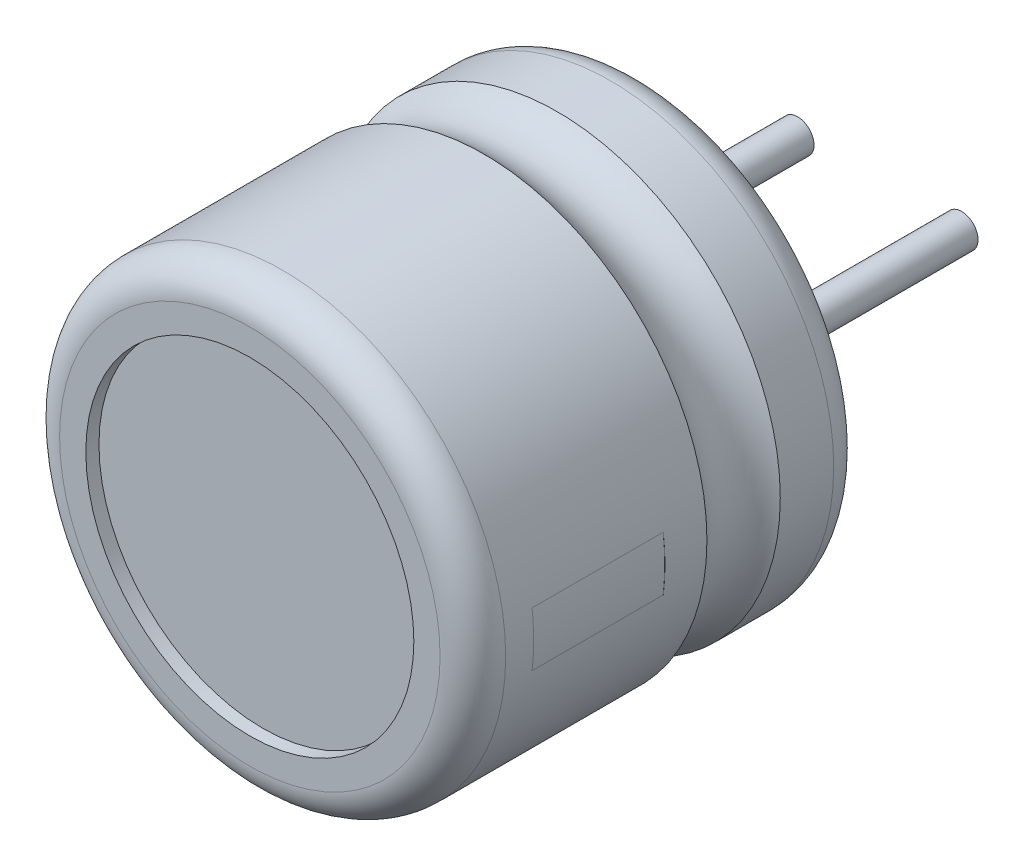
ISO-10303-21;
HEADER;
FILE_DESCRIPTION(('STEP AP214'),'2;1');
FILE_NAME('part.step','',(''),(''),'','','');
FILE_SCHEMA(('AUTOMOTIVE_DESIGN { 1 0 10303 214 1 1 1 1 }'));
ENDSEC;
DATA;
#1=APPLICATION_CONTEXT('core data for automotive mechanical design processes');
#2=APPLICATION_PROTOCOL_DEFINITION('international standard','automotive_design',2000,#1);
#3=PRODUCT_CONTEXT('',#1,'mechanical');
#4=PRODUCT('Part','Part','',(#3));
#5=PRODUCT_RELATED_PRODUCT_CATEGORY('part','',(#4));
#6=PRODUCT_DEFINITION_FORMATION('','',#4);
#7=PRODUCT_DEFINITION_CONTEXT('part definition',#1,'design');
#8=PRODUCT_DEFINITION('design','',#6,#7);
#9=PRODUCT_DEFINITION_SHAPE('','',#8);
#10=(LENGTH_UNIT() NAMED_UNIT(*) SI_UNIT(.MILLI.,.METRE.));
#11=(NAMED_UNIT(*) PLANE_ANGLE_UNIT() SI_UNIT($,.RADIAN.));
#12=(NAMED_UNIT(*) SI_UNIT($,.STERADIAN.) SOLID_ANGLE_UNIT());
#13=UNCERTAINTY_MEASURE_WITH_UNIT(LENGTH_MEASURE(1.E-05),#10,'distance_accuracy_value','');
#14=(GEOMETRIC_REPRESENTATION_CONTEXT(3) GLOBAL_UNCERTAINTY_ASSIGNED_CONTEXT((#13)) GLOBAL_UNIT_ASSIGNED_CONTEXT((#10,
#11,#12)) REPRESENTATION_CONTEXT('',''));
#15=CARTESIAN_POINT('',(0.,0.,0.));
#16=DIRECTION('',(0.,0.,1.));
#17=DIRECTION('',(1.,0.,0.));
#18=AXIS2_PLACEMENT_3D('',#15,#16,#17);
#19=CARTESIAN_POINT('',(0.,0.,5.8));
#20=DIRECTION('',(0.,0.,1.));
#21=DIRECTION('',(1.,0.,0.));
#22=AXIS2_PLACEMENT_3D('',#19,#20,#21);
#23=PLANE('',#22);
#24=CARTESIAN_POINT('',(0.,0.,5.8));
#25=DIRECTION('',(0.,0.,-1.));
#26=DIRECTION('',(-1.,0.,0.));
#27=AXIS2_PLACEMENT_3D('',#24,#25,#26);
#28=CIRCLE('',#27,2.5);
#29=CARTESIAN_POINT('',(-2.5,0.,5.8));
#30=VERTEX_POINT('',#29);
#31=EDGE_CURVE('P0_E26',#30,#30,#28,.T.);
#32=ORIENTED_EDGE('',*,*,#31,.F.);
#33=EDGE_LOOP('',(#32));
#34=FACE_BOUND('',#33,.T.);
#35=ADVANCED_FACE('P0_F23',(#34),#23,.T.);
#36=CARTESIAN_POINT('',(0.,0.,5.8));
#37=DIRECTION('',(0.,0.,-1.));
#38=DIRECTION('',(-1.,0.,0.));
#39=AXIS2_PLACEMENT_3D('',#36,#37,#38);
#40=CYLINDRICAL_SURFACE('',#39,2.5);
#41=CARTESIAN_POINT('',(0.,0.,5.7));
#42=DIRECTION('',(0.,0.,-1.));
#43=DIRECTION('',(-1.,0.,0.));
#44=AXIS2_PLACEMENT_3D('',#41,#42,#43);
#45=CIRCLE('',#44,2.5);
#46=CARTESIAN_POINT('',(-2.5,0.,5.7));
#47=VERTEX_POINT('',#46);
#48=EDGE_CURVE('P0_E12',#47,#47,#45,.F.);
#49=ORIENTED_EDGE('',*,*,#48,.T.);
#50=EDGE_LOOP('',(#49));
#51=FACE_BOUND('',#50,.T.);
#52=ORIENTED_EDGE('',*,*,#31,.T.);
#53=EDGE_LOOP('',(#52));
#54=FACE_BOUND('',#53,.T.);
#55=ADVANCED_FACE('P0_F35',(#51,#54),#40,.T.);
#56=CARTESIAN_POINT('',(0.,0.,5.7));
#57=DIRECTION('',(0.,0.,1.));
#58=DIRECTION('',(1.,0.,0.));
#59=AXIS2_PLACEMENT_3D('',#56,#57,#58);
#60=PLANE('',#59);
#61=ORIENTED_EDGE('',*,*,#48,.F.);
#62=EDGE_LOOP('',(#61));
#63=FACE_BOUND('',#62,.T.);
#64=ADVANCED_FACE('P0_F42',(#63),#60,.F.);
#65=CLOSED_SHELL('',(#35,#55,#64));
#66=MANIFOLD_SOLID_BREP('P0_B1',#65);
#67=CARTESIAN_POINT('',(1.25,0.,0.));
#68=DIRECTION('',(0.,0.,1.));
#69=DIRECTION('',(1.,0.,0.));
#70=AXIS2_PLACEMENT_3D('',#67,#68,#69);
#71=PLANE('',#70);
#72=CARTESIAN_POINT('',(1.25,0.,0.));
#73=DIRECTION('',(0.,0.,-1.));
#74=DIRECTION('',(-1.,0.,0.));
#75=AXIS2_PLACEMENT_3D('',#72,#73,#74);
#76=CIRCLE('',#75,0.25);
#77=CARTESIAN_POINT('',(1.,0.,0.));
#78=VERTEX_POINT('',#77);
#79=EDGE_CURVE('P1_E26',#78,#78,#76,.T.);
#80=ORIENTED_EDGE('',*,*,#79,.F.);
#81=EDGE_LOOP('',(#80));
#82=FACE_BOUND('',#81,.T.);
#83=ADVANCED_FACE('P1_F23',(#82),#71,.T.);
#84=CARTESIAN_POINT('',(1.25,0.,-3.6));
#85=DIRECTION('',(0.,0.,1.));
#86=DIRECTION('',(1.,0.,0.));
#87=AXIS2_PLACEMENT_3D('',#84,#85,#86);
#88=PLANE('',#87);
#89=CARTESIAN_POINT('',(1.25,0.,-3.6));
#90=DIRECTION('',(0.,0.,-1.));
#91=DIRECTION('',(-1.,0.,0.));
#92=AXIS2_PLACEMENT_3D('',#89,#90,#91);
#93=CIRCLE('',#92,0.25);
#94=CARTESIAN_POINT('',(1.,0.,-3.6));
#95=VERTEX_POINT('',#94);
#96=EDGE_CURVE('P1_E12',#95,#95,#93,.F.);
#97=ORIENTED_EDGE('',*,*,#96,.F.);
#98=EDGE_LOOP('',(#97));
#99=FACE_BOUND('',#98,.T.);
#100=ADVANCED_FACE('P1_F38',(#99),#88,.F.);
#101=CARTESIAN_POINT('',(1.25,0.,0.));
#102=DIRECTION('',(0.,0.,-1.));
#103=DIRECTION('',(-1.,0.,0.));
#104=AXIS2_PLACEMENT_3D('',#101,#102,#103);
#105=CYLINDRICAL_SURFACE('',#104,0.25);
#106=ORIENTED_EDGE('',*,*,#79,.T.);
#107=EDGE_LOOP('',(#106));
#108=FACE_BOUND('',#107,.T.);
#109=ORIENTED_EDGE('',*,*,#96,.T.);
#110=EDGE_LOOP('',(#109));
#111=FACE_BOUND('',#110,.T.);
#112=ADVANCED_FACE('P1_F35',(#108,#111),#105,.T.);
#113=CLOSED_SHELL('',(#83,#100,#112));
#114=MANIFOLD_SOLID_BREP('P1_B1',#113);
#115=CARTESIAN_POINT('',(3.275402300416,-0.402168833237,5.073205445782));
#116=DIRECTION('',(-0.121869343405041,-0.992546151641335,0.));
#117=DIRECTION('',(0.992546151641335,-0.121869343405041,0.));
#118=AXIS2_PLACEMENT_3D('',#115,#116,#117);
#119=PLANE('',#118);
#120=DIRECTION('',(0.992546151641335,-0.121869343405041,0.));
#121=VECTOR('',#120,1.);
#122=CARTESIAN_POINT('',(3.275402300416,-0.402168833237,5.073205445782));
#123=LINE('',#122,#121);
#124=CARTESIAN_POINT('',(3.37465691558045,-0.414355767577799,5.073205445782));
#125=VERTEX_POINT('',#124);
#126=CARTESIAN_POINT('',(3.27540230041618,-0.402168833237022,5.073205445782));
#127=VERTEX_POINT('',#126);
#128=EDGE_CURVE('P2_E62',#125,#127,#123,.F.);
#129=ORIENTED_EDGE('',*,*,#128,.T.);
#130=DIRECTION('',(0.,0.,1.));
#131=VECTOR('',#130,1.);
#132=CARTESIAN_POINT('',(3.275402300416,-0.402168833237,5.073205445782));
#133=LINE('',#132,#131);
#134=CARTESIAN_POINT('',(3.27540230041618,-0.402168833237022,3.073205445782));
#135=VERTEX_POINT('',#134);
#136=EDGE_CURVE('P2_E65',#127,#135,#133,.F.);
#137=ORIENTED_EDGE('',*,*,#136,.T.);
#138=DIRECTION('',(0.992546151641335,-0.121869343405041,0.));
#139=VECTOR('',#138,1.);
#140=CARTESIAN_POINT('',(3.275402300416,-0.402168833237,3.073205445782));
#141=LINE('',#140,#139);
#142=CARTESIAN_POINT('',(3.37465691558045,-0.414355767577799,3.073205445782));
#143=VERTEX_POINT('',#142);
#144=EDGE_CURVE('P2_E72',#135,#143,#141,.T.);
#145=ORIENTED_EDGE('',*,*,#144,.T.);
#146=DIRECTION('',(0.,0.,-1.));
#147=VECTOR('',#146,1.);
#148=CARTESIAN_POINT('',(3.37465691558042,-0.414355767578051,5.073205445782));
#149=LINE('',#148,#147);
#150=EDGE_CURVE('P2_E64',#125,#143,#149,.T.);
#151=ORIENTED_EDGE('',*,*,#150,.F.);
#152=EDGE_LOOP('',(#129,#137,#145,#151));
#153=FACE_BOUND('',#152,.T.);
#154=ADVANCED_FACE('P2_F17',(#153),#119,.T.);
#155=CARTESIAN_POINT('',(0.,0.,5.073205445782));
#156=DIRECTION('',(0.,0.,-1.));
#157=DIRECTION('',(-1.,0.,0.));
#158=AXIS2_PLACEMENT_3D('',#155,#156,#157);
#159=CYLINDRICAL_SURFACE('',#158,3.3);
#160=CARTESIAN_POINT('',(0.,0.,5.073205445782));
#161=DIRECTION('',(0.,0.,-1.));
#162=DIRECTION('',(-1.,0.,0.));
#163=AXIS2_PLACEMENT_3D('',#160,#161,#162);
#164=CIRCLE('',#163,3.3);
#165=CARTESIAN_POINT('',(3.27540230041615,0.402168833237274,5.073205445782));
#166=VERTEX_POINT('',#165);
#167=EDGE_CURVE('P2_E20',#166,#127,#164,.T.);
#168=ORIENTED_EDGE('',*,*,#167,.F.);
#169=DIRECTION('',(0.,0.,1.));
#170=VECTOR('',#169,1.);
#171=CARTESIAN_POINT('',(3.27540230041594,0.402168833237505,5.073205445782));
#172=LINE('',#171,#170);
#173=CARTESIAN_POINT('',(3.27540230041612,0.402168833237527,3.073205445782));
#174=VERTEX_POINT('',#173);
#175=EDGE_CURVE('P2_E82',#174,#166,#172,.T.);
#176=ORIENTED_EDGE('',*,*,#175,.F.);
#177=CARTESIAN_POINT('',(0.,0.,3.073205445782));
#178=DIRECTION('',(0.,0.,-1.));
#179=DIRECTION('',(-1.,0.,0.));
#180=AXIS2_PLACEMENT_3D('',#177,#178,#179);
#181=CIRCLE('',#180,3.3);
#182=EDGE_CURVE('P2_E55',#174,#135,#181,.T.);
#183=ORIENTED_EDGE('',*,*,#182,.T.);
#184=ORIENTED_EDGE('',*,*,#136,.F.);
#185=EDGE_LOOP('',(#168,#176,#183,#184));
#186=FACE_BOUND('',#185,.T.);
#187=ADVANCED_FACE('P2_F67',(#186),#159,.F.);
#188=CARTESIAN_POINT('',(3.339040636882,0.,3.073205445782));
#189=DIRECTION('',(0.,0.,1.));
#190=DIRECTION('',(1.,0.,0.));
#191=AXIS2_PLACEMENT_3D('',#188,#189,#190);
#192=PLANE('',#191);
#193=ORIENTED_EDGE('',*,*,#144,.F.);
#194=ORIENTED_EDGE('',*,*,#182,.F.);
#195=DIRECTION('',(-0.992546151641335,-0.121869343405041,0.));
#196=VECTOR('',#195,1.);
#197=CARTESIAN_POINT('',(3.37465691558,0.414355767578,3.073205445782));
#198=LINE('',#197,#196);
#199=CARTESIAN_POINT('',(3.37465691558042,0.414355767578051,3.073205445782));
#200=VERTEX_POINT('',#199);
#201=EDGE_CURVE('P2_E80',#200,#174,#198,.T.);
#202=ORIENTED_EDGE('',*,*,#201,.F.);
#203=CARTESIAN_POINT('',(0.,0.,3.073205445782));
#204=DIRECTION('',(0.,0.,-1.));
#205=DIRECTION('',(-1.,0.,0.));
#206=AXIS2_PLACEMENT_3D('',#203,#204,#205);
#207=CIRCLE('',#206,3.4);
#208=EDGE_CURVE('P2_E78',#143,#200,#207,.F.);
#209=ORIENTED_EDGE('',*,*,#208,.F.);
#210=EDGE_LOOP('',(#193,#194,#202,#209));
#211=FACE_BOUND('',#210,.T.);
#212=ADVANCED_FACE('P2_F91',(#211),#192,.F.);
#213=CARTESIAN_POINT('',(3.37465691558,0.414355767578,5.073205445782));
#214=DIRECTION('',(-0.121869343405041,0.992546151641335,0.));
#215=DIRECTION('',(-0.992546151641335,-0.121869343405041,0.));
#216=AXIS2_PLACEMENT_3D('',#213,#214,#215);
#217=PLANE('',#216);
#218=DIRECTION('',(-0.992546151640715,-0.121869343410088,0.));
#219=VECTOR('',#218,1.);
#220=CARTESIAN_POINT('',(3.37465691558,0.414355767578,5.073205445782));
#221=LINE('',#220,#219);
#222=CARTESIAN_POINT('',(3.37465691558042,0.414355767578051,5.073205445782));
#223=VERTEX_POINT('',#222);
#224=EDGE_CURVE('P2_E35',#223,#166,#221,.T.);
#225=ORIENTED_EDGE('',*,*,#224,.F.);
#226=DIRECTION('',(0.,0.,-1.));
#227=VECTOR('',#226,1.);
#228=CARTESIAN_POINT('',(3.37465691558042,0.414355767578051,5.073205445782));
#229=LINE('',#228,#227);
#230=EDGE_CURVE('P2_E26',#200,#223,#229,.F.);
#231=ORIENTED_EDGE('',*,*,#230,.F.);
#232=ORIENTED_EDGE('',*,*,#201,.T.);
#233=ORIENTED_EDGE('',*,*,#175,.T.);
#234=EDGE_LOOP('',(#225,#231,#232,#233));
#235=FACE_BOUND('',#234,.T.);
#236=ADVANCED_FACE('P2_F89',(#235),#217,.T.);
#237=CARTESIAN_POINT('',(3.339040636882,0.,5.073205445782));
#238=DIRECTION('',(0.,0.,1.));
#239=DIRECTION('',(1.,0.,0.));
#240=AXIS2_PLACEMENT_3D('',#237,#238,#239);
#241=PLANE('',#240);
#242=CARTESIAN_POINT('',(0.,0.,5.073205445782));
#243=DIRECTION('',(0.,0.,-1.));
#244=DIRECTION('',(-1.,0.,0.));
#245=AXIS2_PLACEMENT_3D('',#242,#243,#244);
#246=CIRCLE('',#245,3.4);
#247=EDGE_CURVE('P2_E11',#223,#125,#246,.T.);
#248=ORIENTED_EDGE('',*,*,#247,.F.);
#249=ORIENTED_EDGE('',*,*,#224,.T.);
#250=ORIENTED_EDGE('',*,*,#167,.T.);
#251=ORIENTED_EDGE('',*,*,#128,.F.);
#252=EDGE_LOOP('',(#248,#249,#250,#251));
#253=FACE_BOUND('',#252,.T.);
#254=ADVANCED_FACE('P2_F60',(#253),#241,.T.);
#255=CARTESIAN_POINT('',(0.,0.,5.073205445782));
#256=DIRECTION('',(0.,0.,-1.));
#257=DIRECTION('',(-1.,0.,0.));
#258=AXIS2_PLACEMENT_3D('',#255,#256,#257);
#259=CYLINDRICAL_SURFACE('',#258,3.4);
#260=ORIENTED_EDGE('',*,*,#230,.T.);
#261=ORIENTED_EDGE('',*,*,#247,.T.);
#262=ORIENTED_EDGE('',*,*,#150,.T.);
#263=ORIENTED_EDGE('',*,*,#208,.T.);
#264=EDGE_LOOP('',(#260,#261,#262,#263));
#265=FACE_BOUND('',#264,.T.);
#266=ADVANCED_FACE('P2_F86',(#265),#259,.T.);
#267=CLOSED_SHELL('',(#154,#187,#212,#236,#254,#266));
#268=MANIFOLD_SOLID_BREP('P2_B1',#267);
#269=CARTESIAN_POINT('',(0.,0.,0.2));
#270=DIRECTION('',(0.,0.,1.));
#271=DIRECTION('',(1.,0.,0.));
#272=AXIS2_PLACEMENT_3D('',#269,#270,#271);
#273=PLANE('',#272);
#274=CARTESIAN_POINT('',(0.,0.,0.2));
#275=DIRECTION('',(0.,0.,1.));
#276=DIRECTION('',(1.,0.,0.));
#277=AXIS2_PLACEMENT_3D('',#274,#275,#276);
#278=CIRCLE('',#277,2.5);
#279=CARTESIAN_POINT('',(2.5,0.,0.2));
#280=VERTEX_POINT('',#279);
#281=EDGE_CURVE('P3_E95',#280,#280,#278,.F.);
#282=ORIENTED_EDGE('',*,*,#281,.T.);
#283=EDGE_LOOP('',(#282));
#284=FACE_BOUND('',#283,.T.);
#285=ADVANCED_FACE('P3_F25',(#284),#273,.F.);
#286=CARTESIAN_POINT('',(0.,0.,0.));
#287=DIRECTION('',(0.,0.,1.));
#288=DIRECTION('',(1.,0.,0.));
#289=AXIS2_PLACEMENT_3D('',#286,#287,#288);
#290=CYLINDRICAL_SURFACE('',#289,2.5);
#291=ORIENTED_EDGE('',*,*,#281,.F.);
#292=EDGE_LOOP('',(#291));
#293=FACE_BOUND('',#292,.T.);
#294=CARTESIAN_POINT('',(0.,0.,0.));
#295=DIRECTION('',(0.,0.,1.));
#296=DIRECTION('',(1.,0.,0.));
#297=AXIS2_PLACEMENT_3D('',#294,#295,#296);
#298=CIRCLE('',#297,2.5);
#299=CARTESIAN_POINT('',(2.5,0.,0.));
#300=VERTEX_POINT('',#299);
#301=EDGE_CURVE('P3_E94',#300,#300,#298,.F.);
#302=ORIENTED_EDGE('',*,*,#301,.T.);
#303=EDGE_LOOP('',(#302));
#304=FACE_BOUND('',#303,.T.);
#305=ADVANCED_FACE('P3_F143',(#293,#304),#290,.F.);
#306=CARTESIAN_POINT('',(0.,0.,0.));
#307=DIRECTION('',(0.,0.,1.));
#308=DIRECTION('',(1.,0.,0.));
#309=AXIS2_PLACEMENT_3D('',#306,#307,#308);
#310=PLANE('',#309);
#311=ORIENTED_EDGE('',*,*,#301,.F.);
#312=EDGE_LOOP('',(#311));
#313=FACE_BOUND('',#312,.T.);
#314=CARTESIAN_POINT('',(0.,0.,0.));
#315=DIRECTION('',(0.,0.,1.));
#316=DIRECTION('',(-1.,0.,0.));
#317=AXIS2_PLACEMENT_3D('',#314,#315,#316);
#318=CIRCLE('',#317,2.9);
#319=CARTESIAN_POINT('',(-2.9,0.,0.));
#320=VERTEX_POINT('',#319);
#321=CARTESIAN_POINT('',(2.9,0.,0.));
#322=VERTEX_POINT('',#321);
#323=EDGE_CURVE('P3_E92',#320,#322,#318,.T.);
#324=ORIENTED_EDGE('',*,*,#323,.F.);
#325=CARTESIAN_POINT('',(0.,0.,0.));
#326=DIRECTION('',(0.,0.,1.));
#327=DIRECTION('',(1.,0.,0.));
#328=AXIS2_PLACEMENT_3D('',#325,#326,#327);
#329=CIRCLE('',#328,2.9);
#330=EDGE_CURVE('P3_E86',#322,#320,#329,.T.);
#331=ORIENTED_EDGE('',*,*,#330,.F.);
#332=EDGE_LOOP('',(#324,#331));
#333=FACE_BOUND('',#332,.T.);
#334=ADVANCED_FACE('P3_F91',(#313,#333),#310,.F.);
#335=CARTESIAN_POINT('',(0.,0.,5.7));
#336=DIRECTION('',(0.,0.,1.));
#337=DIRECTION('',(1.,0.,0.));
#338=AXIS2_PLACEMENT_3D('',#335,#336,#337);
#339=PLANE('',#338);
#340=CARTESIAN_POINT('',(0.,0.,5.7));
#341=DIRECTION('',(0.,0.,-1.));
#342=DIRECTION('',(-1.,0.,0.));
#343=AXIS2_PLACEMENT_3D('',#340,#341,#342);
#344=CIRCLE('',#343,2.5);
#345=CARTESIAN_POINT('',(-2.5,0.,5.7));
#346=VERTEX_POINT('',#345);
#347=EDGE_CURVE('P3_E101',#346,#346,#344,.F.);
#348=ORIENTED_EDGE('',*,*,#347,.T.);
#349=EDGE_LOOP('',(#348));
#350=FACE_BOUND('',#349,.T.);
#351=ADVANCED_FACE('P3_F122',(#350),#339,.T.);
#352=CARTESIAN_POINT('',(0.,0.,0.5));
#353=DIRECTION('',(0.,0.,1.));
#354=DIRECTION('',(1.,0.,0.));
#355=AXIS2_PLACEMENT_3D('',#352,#353,#354);
#356=TOROIDAL_SURFACE('',#355,2.9,0.5);
#357=ORIENTED_EDGE('',*,*,#323,.T.);
#358=ORIENTED_EDGE('',*,*,#330,.T.);
#359=EDGE_LOOP('',(#357,#358));
#360=FACE_BOUND('',#359,.T.);
#361=CARTESIAN_POINT('',(0.,0.,0.5));
#362=DIRECTION('',(0.,0.,1.));
#363=DIRECTION('',(1.,0.,0.));
#364=AXIS2_PLACEMENT_3D('',#361,#362,#363);
#365=CIRCLE('',#364,3.4);
#366=CARTESIAN_POINT('',(3.4,0.,0.5));
#367=VERTEX_POINT('',#366);
#368=EDGE_CURVE('P3_E109',#367,#367,#365,.T.);
#369=ORIENTED_EDGE('',*,*,#368,.F.);
#370=EDGE_LOOP('',(#369));
#371=FACE_BOUND('',#370,.T.);
#372=ADVANCED_FACE('P3_F99',(#360,#371),#356,.T.);
#373=CARTESIAN_POINT('',(0.,0.,6.));
#374=DIRECTION('',(0.,0.,-1.));
#375=DIRECTION('',(-1.,0.,0.));
#376=AXIS2_PLACEMENT_3D('',#373,#374,#375);
#377=CYLINDRICAL_SURFACE('',#376,2.5);
#378=CARTESIAN_POINT('',(0.,0.,6.));
#379=DIRECTION('',(0.,0.,-1.));
#380=DIRECTION('',(-1.,0.,0.));
#381=AXIS2_PLACEMENT_3D('',#378,#379,#380);
#382=CIRCLE('',#381,2.5);
#383=CARTESIAN_POINT('',(-2.5,0.,6.));
#384=VERTEX_POINT('',#383);
#385=EDGE_CURVE('P3_E234',#384,#384,#382,.T.);
#386=ORIENTED_EDGE('',*,*,#385,.F.);
#387=EDGE_LOOP('',(#386));
#388=FACE_BOUND('',#387,.T.);
#389=ORIENTED_EDGE('',*,*,#347,.F.);
#390=EDGE_LOOP('',(#389));
#391=FACE_BOUND('',#390,.T.);
#392=ADVANCED_FACE('P3_F121',(#388,#391),#377,.F.);
#393=CARTESIAN_POINT('',(0.,0.,0.));
#394=DIRECTION('',(0.,0.,1.));
#395=DIRECTION('',(1.,0.,0.));
#396=AXIS2_PLACEMENT_3D('',#393,#394,#395);
#397=CYLINDRICAL_SURFACE('',#396,3.4);
#398=ORIENTED_EDGE('',*,*,#368,.T.);
#399=EDGE_LOOP('',(#398));
#400=FACE_BOUND('',#399,.T.);
#401=CARTESIAN_POINT('',(0.,0.,1.31434670772803));
#402=DIRECTION('',(0.,0.,1.));
#403=DIRECTION('',(1.,0.,0.));
#404=AXIS2_PLACEMENT_3D('',#401,#402,#403);
#405=CIRCLE('',#404,3.40000000000003);
#406=CARTESIAN_POINT('',(3.40000000000003,0.,1.31434670772803));
#407=VERTEX_POINT('',#406);
#408=EDGE_CURVE('P3_E130',#407,#407,#405,.F.);
#409=ORIENTED_EDGE('',*,*,#408,.T.);
#410=EDGE_LOOP('',(#409));
#411=FACE_BOUND('',#410,.T.);
#412=ADVANCED_FACE('P3_F262',(#400,#411),#397,.T.);
#413=CARTESIAN_POINT('',(0.,0.,5.073205445782));
#414=DIRECTION('',(0.,0.,-1.));
#415=DIRECTION('',(-1.,0.,0.));
#416=AXIS2_PLACEMENT_3D('',#413,#414,#415);
#417=CYLINDRICAL_SURFACE('',#416,3.3);
#418=DIRECTION('',(0.,0.,1.));
#419=VECTOR('',#418,1.);
#420=CARTESIAN_POINT('',(3.275402300416,-0.402168833237,5.073205445782));
#421=LINE('',#420,#419);
#422=CARTESIAN_POINT('',(3.27540230041618,-0.402168833237022,5.073205445782));
#423=VERTEX_POINT('',#422);
#424=CARTESIAN_POINT('',(3.27540230041618,-0.402168833237022,3.073205445782));
#425=VERTEX_POINT('',#424);
#426=EDGE_CURVE('P3_E128',#423,#425,#421,.F.);
#427=ORIENTED_EDGE('',*,*,#426,.T.);
#428=CARTESIAN_POINT('',(0.,0.,3.073205445782));
#429=DIRECTION('',(0.,0.,-1.));
#430=DIRECTION('',(-1.,0.,0.));
#431=AXIS2_PLACEMENT_3D('',#428,#429,#430);
#432=CIRCLE('',#431,3.3);
#433=CARTESIAN_POINT('',(3.27540230041615,0.402168833237274,3.073205445782));
#434=VERTEX_POINT('',#433);
#435=EDGE_CURVE('P3_E189',#434,#425,#432,.T.);
#436=ORIENTED_EDGE('',*,*,#435,.F.);
#437=DIRECTION('',(0.,0.,1.));
#438=VECTOR('',#437,1.);
#439=CARTESIAN_POINT('',(3.27540230041594,0.402168833237505,5.073205445782));
#440=LINE('',#439,#438);
#441=CARTESIAN_POINT('',(3.27540230041615,0.402168833237274,5.073205445782));
#442=VERTEX_POINT('',#441);
#443=EDGE_CURVE('P3_E133',#434,#442,#440,.T.);
#444=ORIENTED_EDGE('',*,*,#443,.T.);
#445=CARTESIAN_POINT('',(0.,0.,5.073205445782));
#446=DIRECTION('',(0.,0.,-1.));
#447=DIRECTION('',(-1.,0.,0.));
#448=AXIS2_PLACEMENT_3D('',#445,#446,#447);
#449=CIRCLE('',#448,3.3);
#450=EDGE_CURVE('P3_E70',#442,#423,#449,.T.);
#451=ORIENTED_EDGE('',*,*,#450,.T.);
#452=EDGE_LOOP('',(#427,#436,#444,#451));
#453=FACE_BOUND('',#452,.T.);
#454=ADVANCED_FACE('P3_F209',(#453),#417,.T.);
#455=CARTESIAN_POINT('',(0.,0.,6.));
#456=DIRECTION('',(0.,0.,1.));
#457=DIRECTION('',(1.,0.,0.));
#458=AXIS2_PLACEMENT_3D('',#455,#456,#457);
#459=PLANE('',#458);
#460=ORIENTED_EDGE('',*,*,#385,.T.);
#461=EDGE_LOOP('',(#460));
#462=FACE_BOUND('',#461,.T.);
#463=CARTESIAN_POINT('',(0.,0.,6.));
#464=DIRECTION('',(0.,0.,-1.));
#465=DIRECTION('',(1.,0.,0.));
#466=AXIS2_PLACEMENT_3D('',#463,#464,#465);
#467=CIRCLE('',#466,2.9);
#468=CARTESIAN_POINT('',(2.9,0.,6.));
#469=VERTEX_POINT('',#468);
#470=CARTESIAN_POINT('',(-2.9,0.,6.));
#471=VERTEX_POINT('',#470);
#472=EDGE_CURVE('P3_E179',#469,#471,#467,.T.);
#473=ORIENTED_EDGE('',*,*,#472,.F.);
#474=CARTESIAN_POINT('',(0.,0.,6.));
#475=DIRECTION('',(0.,0.,-1.));
#476=DIRECTION('',(-1.,0.,0.));
#477=AXIS2_PLACEMENT_3D('',#474,#475,#476);
#478=CIRCLE('',#477,2.9);
#479=EDGE_CURVE('P3_E77',#471,#469,#478,.T.);
#480=ORIENTED_EDGE('',*,*,#479,.F.);
#481=EDGE_LOOP('',(#473,#480));
#482=FACE_BOUND('',#481,.T.);
#483=ADVANCED_FACE('P3_F198',(#462,#482),#459,.T.);
#484=CARTESIAN_POINT('',(3.37465691558,0.414355767578,5.073205445782));
#485=DIRECTION('',(-0.121869343405041,0.992546151641335,0.));
#486=DIRECTION('',(-0.992546151641335,-0.121869343405041,0.));
#487=AXIS2_PLACEMENT_3D('',#484,#485,#486);
#488=PLANE('',#487);
#489=DIRECTION('',(0.,0.,1.));
#490=VECTOR('',#489,1.);
#491=CARTESIAN_POINT('',(3.37465691558043,0.414355767578052,0.));
#492=LINE('',#491,#490);
#493=CARTESIAN_POINT('',(3.37465691558043,0.414355767578052,5.073205445782));
#494=VERTEX_POINT('',#493);
#495=CARTESIAN_POINT('',(3.37465691558043,0.414355767578052,3.073205445782));
#496=VERTEX_POINT('',#495);
#497=EDGE_CURVE('P3_E191',#494,#496,#492,.F.);
#498=ORIENTED_EDGE('',*,*,#497,.F.);
#499=DIRECTION('',(-0.992546151640715,-0.121869343410088,0.));
#500=VECTOR('',#499,1.);
#501=CARTESIAN_POINT('',(3.37465691558,0.414355767578,5.073205445782));
#502=LINE('',#501,#500);
#503=EDGE_CURVE('P3_E176',#494,#442,#502,.T.);
#504=ORIENTED_EDGE('',*,*,#503,.T.);
#505=ORIENTED_EDGE('',*,*,#443,.F.);
#506=DIRECTION('',(-0.992546151640715,-0.121869343410088,0.));
#507=VECTOR('',#506,1.);
#508=CARTESIAN_POINT('',(3.37465691558,0.414355767578,3.073205445782));
#509=LINE('',#508,#507);
#510=EDGE_CURVE('P3_E132',#496,#434,#509,.T.);
#511=ORIENTED_EDGE('',*,*,#510,.F.);
#512=EDGE_LOOP('',(#498,#504,#505,#511));
#513=FACE_BOUND('',#512,.T.);
#514=ADVANCED_FACE('P3_F208',(#513),#488,.F.);
#515=CARTESIAN_POINT('',(3.339040636882,0.,3.073205445782));
#516=DIRECTION('',(0.,0.,1.));
#517=DIRECTION('',(1.,0.,0.));
#518=AXIS2_PLACEMENT_3D('',#515,#516,#517);
#519=PLANE('',#518);
#520=ORIENTED_EDGE('',*,*,#510,.T.);
#521=ORIENTED_EDGE('',*,*,#435,.T.);
#522=DIRECTION('',(0.992546151641335,-0.121869343405041,0.));
#523=VECTOR('',#522,1.);
#524=CARTESIAN_POINT('',(3.275402300416,-0.402168833237,3.073205445782));
#525=LINE('',#524,#523);
#526=CARTESIAN_POINT('',(3.37465691558046,-0.4143557675778,3.073205445782));
#527=VERTEX_POINT('',#526);
#528=EDGE_CURVE('P3_E181',#425,#527,#525,.T.);
#529=ORIENTED_EDGE('',*,*,#528,.T.);
#530=CARTESIAN_POINT('',(0.,0.,3.073205445782));
#531=DIRECTION('',(0.,0.,1.));
#532=DIRECTION('',(1.,0.,0.));
#533=AXIS2_PLACEMENT_3D('',#530,#531,#532);
#534=CIRCLE('',#533,3.4);
#535=EDGE_CURVE('P3_E186',#496,#527,#534,.F.);
#536=ORIENTED_EDGE('',*,*,#535,.F.);
#537=EDGE_LOOP('',(#520,#521,#529,#536));
#538=FACE_BOUND('',#537,.T.);
#539=ADVANCED_FACE('P3_F337',(#538),#519,.T.);
#540=CARTESIAN_POINT('',(3.275402300416,-0.402168833237,5.073205445782));
#541=DIRECTION('',(-0.121869343405041,-0.992546151641335,0.));
#542=DIRECTION('',(0.992546151641335,-0.121869343405041,0.));
#543=AXIS2_PLACEMENT_3D('',#540,#541,#542);
#544=PLANE('',#543);
#545=ORIENTED_EDGE('',*,*,#426,.F.);
#546=DIRECTION('',(0.992546151640715,-0.121869343410088,0.));
#547=VECTOR('',#546,1.);
#548=CARTESIAN_POINT('',(3.275402300416,-0.402168833237,5.073205445782));
#549=LINE('',#548,#547);
#550=CARTESIAN_POINT('',(3.37465691558043,-0.414355767578052,5.073205445782));
#551=VERTEX_POINT('',#550);
#552=EDGE_CURVE('P3_E45',#423,#551,#549,.T.);
#553=ORIENTED_EDGE('',*,*,#552,.T.);
#554=DIRECTION('',(0.,0.,1.));
#555=VECTOR('',#554,1.);
#556=CARTESIAN_POINT('',(3.37465691558043,-0.414355767578052,0.));
#557=LINE('',#556,#555);
#558=EDGE_CURVE('P3_E182',#527,#551,#557,.T.);
#559=ORIENTED_EDGE('',*,*,#558,.F.);
#560=ORIENTED_EDGE('',*,*,#528,.F.);
#561=EDGE_LOOP('',(#545,#553,#559,#560));
#562=FACE_BOUND('',#561,.T.);
#563=ADVANCED_FACE('P3_F345',(#562),#544,.F.);
#564=CARTESIAN_POINT('',(3.339040636882,0.,5.073205445782));
#565=DIRECTION('',(0.,0.,1.));
#566=DIRECTION('',(1.,0.,0.));
#567=AXIS2_PLACEMENT_3D('',#564,#565,#566);
#568=PLANE('',#567);
#569=ORIENTED_EDGE('',*,*,#503,.F.);
#570=CARTESIAN_POINT('',(0.,0.,5.073205445782));
#571=DIRECTION('',(0.,0.,1.));
#572=DIRECTION('',(1.,0.,0.));
#573=AXIS2_PLACEMENT_3D('',#570,#571,#572);
#574=CIRCLE('',#573,3.4);
#575=EDGE_CURVE('P3_E185',#551,#494,#574,.T.);
#576=ORIENTED_EDGE('',*,*,#575,.F.);
#577=ORIENTED_EDGE('',*,*,#552,.F.);
#578=ORIENTED_EDGE('',*,*,#450,.F.);
#579=EDGE_LOOP('',(#569,#576,#577,#578));
#580=FACE_BOUND('',#579,.T.);
#581=ADVANCED_FACE('P3_F353',(#580),#568,.F.);
#582=CARTESIAN_POINT('',(0.,0.,5.5));
#583=DIRECTION('',(0.,0.,-1.));
#584=DIRECTION('',(-1.,0.,0.));
#585=AXIS2_PLACEMENT_3D('',#582,#583,#584);
#586=TOROIDAL_SURFACE('',#585,2.9,0.5);
#587=CARTESIAN_POINT('',(0.,0.,5.5));
#588=DIRECTION('',(0.,0.,1.));
#589=DIRECTION('',(1.,0.,0.));
#590=AXIS2_PLACEMENT_3D('',#587,#588,#589);
#591=CIRCLE('',#590,3.4);
#592=CARTESIAN_POINT('',(3.4,0.,5.5));
#593=VERTEX_POINT('',#592);
#594=EDGE_CURVE('P3_E36',#593,#593,#591,.F.);
#595=ORIENTED_EDGE('',*,*,#594,.F.);
#596=EDGE_LOOP('',(#595));
#597=FACE_BOUND('',#596,.T.);
#598=ORIENTED_EDGE('',*,*,#472,.T.);
#599=ORIENTED_EDGE('',*,*,#479,.T.);
#600=EDGE_LOOP('',(#598,#599));
#601=FACE_BOUND('',#600,.T.);
#602=ADVANCED_FACE('P3_F163',(#597,#601),#586,.T.);
#603=CARTESIAN_POINT('',(0.,0.,1.873363702103));
#604=DIRECTION('',(0.,0.,1.));
#605=DIRECTION('',(1.,0.,0.));
#606=AXIS2_PLACEMENT_3D('',#603,#604,#605);
#607=TOROIDAL_SURFACE('',#606,3.9,0.75);
#608=ORIENTED_EDGE('',*,*,#408,.F.);
#609=EDGE_LOOP('',(#608));
#610=FACE_BOUND('',#609,.T.);
#611=CARTESIAN_POINT('',(0.,0.,2.432380696478));
#612=DIRECTION('',(0.,0.,1.));
#613=DIRECTION('',(1.,0.,0.));
#614=AXIS2_PLACEMENT_3D('',#611,#612,#613);
#615=CIRCLE('',#614,3.4);
#616=CARTESIAN_POINT('',(3.4,0.,2.432380696478));
#617=VERTEX_POINT('',#616);
#618=EDGE_CURVE('P3_E13',#617,#617,#615,.T.);
#619=ORIENTED_EDGE('',*,*,#618,.F.);
#620=EDGE_LOOP('',(#619));
#621=FACE_BOUND('',#620,.T.);
#622=ADVANCED_FACE('P3_F157',(#610,#621),#607,.F.);
#623=CARTESIAN_POINT('',(0.,0.,0.));
#624=DIRECTION('',(0.,0.,1.));
#625=DIRECTION('',(1.,0.,0.));
#626=AXIS2_PLACEMENT_3D('',#623,#624,#625);
#627=CYLINDRICAL_SURFACE('',#626,3.4);
#628=ORIENTED_EDGE('',*,*,#497,.T.);
#629=ORIENTED_EDGE('',*,*,#535,.T.);
#630=ORIENTED_EDGE('',*,*,#558,.T.);
#631=ORIENTED_EDGE('',*,*,#575,.T.);
#632=EDGE_LOOP('',(#628,#629,#630,#631));
#633=FACE_BOUND('',#632,.T.);
#634=ORIENTED_EDGE('',*,*,#594,.T.);
#635=EDGE_LOOP('',(#634));
#636=FACE_BOUND('',#635,.T.);
#637=ORIENTED_EDGE('',*,*,#618,.T.);
#638=EDGE_LOOP('',(#637));
#639=FACE_BOUND('',#638,.T.);
#640=ADVANCED_FACE('P3_F155',(#633,#636,#639),#627,.T.);
#641=CLOSED_SHELL('',(#285,#305,#334,#351,#372,#392,#412,#454,#483,#514,#539,#563,#581,#602,
#622,#640));
#642=MANIFOLD_SOLID_BREP('P3_B1',#641);
#643=CARTESIAN_POINT('',(-1.25,0.,0.));
#644=DIRECTION('',(0.,0.,1.));
#645=DIRECTION('',(1.,0.,0.));
#646=AXIS2_PLACEMENT_3D('',#643,#644,#645);
#647=PLANE('',#646);
#648=CARTESIAN_POINT('',(-1.25,0.,0.));
#649=DIRECTION('',(0.,0.,-1.));
#650=DIRECTION('',(-1.,0.,0.));
#651=AXIS2_PLACEMENT_3D('',#648,#649,#650);
#652=CIRCLE('',#651,0.25);
#653=CARTESIAN_POINT('',(-1.5,0.,0.));
#654=VERTEX_POINT('',#653);
#655=EDGE_CURVE('P4_E26',#654,#654,#652,.T.);
#656=ORIENTED_EDGE('',*,*,#655,.F.);
#657=EDGE_LOOP('',(#656));
#658=FACE_BOUND('',#657,.T.);
#659=ADVANCED_FACE('P4_F23',(#658),#647,.T.);
#660=CARTESIAN_POINT('',(-1.25,0.,-3.6));
#661=DIRECTION('',(0.,0.,1.));
#662=DIRECTION('',(1.,0.,0.));
#663=AXIS2_PLACEMENT_3D('',#660,#661,#662);
#664=PLANE('',#663);
#665=CARTESIAN_POINT('',(-1.25,0.,-3.6));
#666=DIRECTION('',(0.,0.,-1.));
#667=DIRECTION('',(-1.,0.,0.));
#668=AXIS2_PLACEMENT_3D('',#665,#666,#667);
#669=CIRCLE('',#668,0.25);
#670=CARTESIAN_POINT('',(-1.5,0.,-3.6));
#671=VERTEX_POINT('',#670);
#672=EDGE_CURVE('P4_E12',#671,#671,#669,.F.);
#673=ORIENTED_EDGE('',*,*,#672,.F.);
#674=EDGE_LOOP('',(#673));
#675=FACE_BOUND('',#674,.T.);
#676=ADVANCED_FACE('P4_F38',(#675),#664,.F.);
#677=CARTESIAN_POINT('',(-1.25,0.,0.));
#678=DIRECTION('',(0.,0.,-1.));
#679=DIRECTION('',(-1.,0.,0.));
#680=AXIS2_PLACEMENT_3D('',#677,#678,#679);
#681=CYLINDRICAL_SURFACE('',#680,0.25);
#682=ORIENTED_EDGE('',*,*,#655,.T.);
#683=EDGE_LOOP('',(#682));
#684=FACE_BOUND('',#683,.T.);
#685=ORIENTED_EDGE('',*,*,#672,.T.);
#686=EDGE_LOOP('',(#685));
#687=FACE_BOUND('',#686,.T.);
#688=ADVANCED_FACE('P4_F35',(#684,#687),#681,.T.);
#689=CLOSED_SHELL('',(#659,#676,#688));
#690=MANIFOLD_SOLID_BREP('P4_B1',#689);
#691=CARTESIAN_POINT('',(0.,0.,0.1));
#692=DIRECTION('',(0.,0.,1.));
#693=DIRECTION('',(1.,0.,0.));
#694=AXIS2_PLACEMENT_3D('',#691,#692,#693);
#695=PLANE('',#694);
#696=CARTESIAN_POINT('',(0.,0.,0.1));
#697=DIRECTION('',(0.,0.,1.));
#698=DIRECTION('',(1.,0.,0.));
#699=AXIS2_PLACEMENT_3D('',#696,#697,#698);
#700=CIRCLE('',#699,2.5);
#701=CARTESIAN_POINT('',(2.5,0.,0.1));
#702=VERTEX_POINT('',#701);
#703=EDGE_CURVE('P5_E18',#702,#702,#700,.T.);
#704=ORIENTED_EDGE('',*,*,#703,.F.);
#705=EDGE_LOOP('',(#704));
#706=FACE_BOUND('',#705,.T.);
#707=ADVANCED_FACE('P5_F15',(#706),#695,.F.);
#708=CARTESIAN_POINT('',(0.,0.,0.1));
#709=DIRECTION('',(0.,0.,1.));
#710=DIRECTION('',(1.,0.,0.));
#711=AXIS2_PLACEMENT_3D('',#708,#709,#710);
#712=CYLINDRICAL_SURFACE('',#711,2.5);
#713=ORIENTED_EDGE('',*,*,#703,.T.);
#714=EDGE_LOOP('',(#713));
#715=FACE_BOUND('',#714,.T.);
#716=CARTESIAN_POINT('',(0.,0.,0.2));
#717=DIRECTION('',(0.,0.,1.));
#718=DIRECTION('',(1.,0.,0.));
#719=AXIS2_PLACEMENT_3D('',#716,#717,#718);
#720=CIRCLE('',#719,2.5);
#721=CARTESIAN_POINT('',(2.5,0.,0.2));
#722=VERTEX_POINT('',#721);
#723=EDGE_CURVE('P5_E10',#722,#722,#720,.T.);
#724=ORIENTED_EDGE('',*,*,#723,.F.);
#725=EDGE_LOOP('',(#724));
#726=FACE_BOUND('',#725,.T.);
#727=ADVANCED_FACE('P5_F27',(#715,#726),#712,.T.);
#728=CARTESIAN_POINT('',(0.,0.,0.2));
#729=DIRECTION('',(0.,0.,1.));
#730=DIRECTION('',(1.,0.,0.));
#731=AXIS2_PLACEMENT_3D('',#728,#729,#730);
#732=PLANE('',#731);
#733=ORIENTED_EDGE('',*,*,#723,.T.);
#734=EDGE_LOOP('',(#733));
#735=FACE_BOUND('',#734,.T.);
#736=ADVANCED_FACE('P5_F35',(#735),#732,.T.);
#737=CLOSED_SHELL('',(#707,#727,#736));
#738=MANIFOLD_SOLID_BREP('P5_B1',#737);
#739=ADVANCED_BREP_SHAPE_REPRESENTATION('',(#18,#66,#114,#268,#642,#690,#738),#14);
#740=SHAPE_DEFINITION_REPRESENTATION(#9,#739);
ENDSEC;
END-ISO-10303-21;
